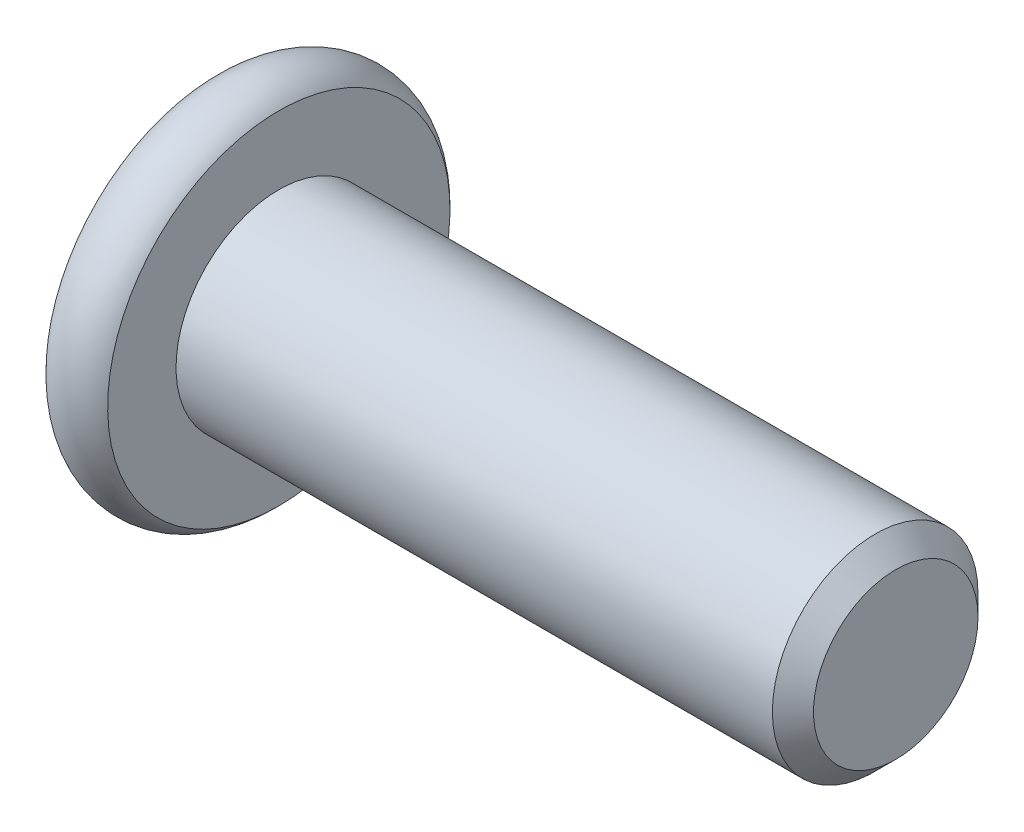
ISO-10303-21;
HEADER;
FILE_DESCRIPTION(('STEP AP214'),'2;1');
FILE_NAME('part.step','',(''),(''),'','','');
FILE_SCHEMA(('AUTOMOTIVE_DESIGN { 1 0 10303 214 1 1 1 1 }'));
ENDSEC;
DATA;
#1=APPLICATION_CONTEXT('core data for automotive mechanical design processes');
#2=APPLICATION_PROTOCOL_DEFINITION('international standard','automotive_design',2000,#1);
#3=PRODUCT_CONTEXT('',#1,'mechanical');
#4=PRODUCT('Part','Part','',(#3));
#5=PRODUCT_RELATED_PRODUCT_CATEGORY('part','',(#4));
#6=PRODUCT_DEFINITION_FORMATION('','',#4);
#7=PRODUCT_DEFINITION_CONTEXT('part definition',#1,'design');
#8=PRODUCT_DEFINITION('design','',#6,#7);
#9=PRODUCT_DEFINITION_SHAPE('','',#8);
#10=(LENGTH_UNIT() NAMED_UNIT(*) SI_UNIT(.MILLI.,.METRE.));
#11=(NAMED_UNIT(*) PLANE_ANGLE_UNIT() SI_UNIT($,.RADIAN.));
#12=(NAMED_UNIT(*) SI_UNIT($,.STERADIAN.) SOLID_ANGLE_UNIT());
#13=UNCERTAINTY_MEASURE_WITH_UNIT(LENGTH_MEASURE(1.E-05),#10,'distance_accuracy_value','');
#14=(GEOMETRIC_REPRESENTATION_CONTEXT(3) GLOBAL_UNCERTAINTY_ASSIGNED_CONTEXT((#13)) GLOBAL_UNIT_ASSIGNED_CONTEXT((#10,
#11,#12)) REPRESENTATION_CONTEXT('',''));
#15=CARTESIAN_POINT('',(0.,0.,0.));
#16=DIRECTION('',(0.,0.,1.));
#17=DIRECTION('',(1.,0.,0.));
#18=AXIS2_PLACEMENT_3D('',#15,#16,#17);
#19=CARTESIAN_POINT('',(-15.,0.,0.));
#20=DIRECTION('',(1.,0.,0.));
#21=DIRECTION('',(0.,0.,-1.));
#22=AXIS2_PLACEMENT_3D('',#19,#20,#21);
#23=CYLINDRICAL_SURFACE('',#22,2.5);
#24=CARTESIAN_POINT('',(-0.5,0.,0.));
#25=DIRECTION('',(1.,0.,0.));
#26=DIRECTION('',(0.,0.,-1.));
#27=AXIS2_PLACEMENT_3D('',#24,#25,#26);
#28=CIRCLE('',#27,2.5);
#29=CARTESIAN_POINT('',(-0.5,0.,-2.5));
#30=VERTEX_POINT('',#29);
#31=EDGE_CURVE('E53',#30,#30,#28,.F.);
#32=ORIENTED_EDGE('',*,*,#31,.T.);
#33=EDGE_LOOP('',(#32));
#34=FACE_BOUND('',#33,.T.);
#35=CARTESIAN_POINT('',(-15.,0.,0.));
#36=DIRECTION('',(-1.,0.,0.));
#37=DIRECTION('',(0.,-1.,0.));
#38=AXIS2_PLACEMENT_3D('',#35,#36,#37);
#39=CIRCLE('',#38,2.5);
#40=CARTESIAN_POINT('',(-15.,-2.50000000000001,0.));
#41=VERTEX_POINT('',#40);
#42=EDGE_CURVE('E129',#41,#41,#39,.F.);
#43=ORIENTED_EDGE('',*,*,#42,.T.);
#44=EDGE_LOOP('',(#43));
#45=FACE_BOUND('',#44,.T.);
#46=ADVANCED_FACE('F39',(#34,#45),#23,.T.);
#47=CARTESIAN_POINT('',(0.,0.,0.));
#48=DIRECTION('',(1.,0.,0.));
#49=DIRECTION('',(0.,0.,-1.));
#50=AXIS2_PLACEMENT_3D('',#47,#48,#49);
#51=PLANE('',#50);
#52=CARTESIAN_POINT('',(0.,0.,0.));
#53=DIRECTION('',(1.,0.,0.));
#54=DIRECTION('',(0.,0.,-1.));
#55=AXIS2_PLACEMENT_3D('',#52,#53,#54);
#56=CIRCLE('',#55,2.);
#57=CARTESIAN_POINT('',(0.,0.,-2.));
#58=VERTEX_POINT('',#57);
#59=EDGE_CURVE('E132',#58,#58,#56,.T.);
#60=ORIENTED_EDGE('',*,*,#59,.T.);
#61=EDGE_LOOP('',(#60));
#62=FACE_BOUND('',#61,.T.);
#63=ADVANCED_FACE('F142',(#62),#51,.T.);
#64=CARTESIAN_POINT('',(0.,0.,0.));
#65=DIRECTION('',(-1.,0.,0.));
#66=DIRECTION('',(0.,0.,1.));
#67=AXIS2_PLACEMENT_3D('',#64,#65,#66);
#68=CONICAL_SURFACE('',#67,2.,0.785398163397446);
#69=ORIENTED_EDGE('',*,*,#31,.F.);
#70=EDGE_LOOP('',(#69));
#71=FACE_BOUND('',#70,.T.);
#72=ORIENTED_EDGE('',*,*,#59,.F.);
#73=EDGE_LOOP('',(#72));
#74=FACE_BOUND('',#73,.T.);
#75=ADVANCED_FACE('F41',(#71,#74),#68,.T.);
#76=CARTESIAN_POINT('',(-16.5,0.,0.));
#77=DIRECTION('',(1.,0.,0.));
#78=DIRECTION('',(0.,1.,0.));
#79=AXIS2_PLACEMENT_3D('',#76,#77,#78);
#80=PLANE('',#79);
#81=CARTESIAN_POINT('',(-16.5,0.,0.));
#82=DIRECTION('',(-1.,0.,0.));
#83=DIRECTION('',(0.,-1.,0.));
#84=AXIS2_PLACEMENT_3D('',#81,#82,#83);
#85=CIRCLE('',#84,1.78205080756889);
#86=CARTESIAN_POINT('',(-16.5,-1.78205080756883,0.));
#87=VERTEX_POINT('',#86);
#88=EDGE_CURVE('E247',#87,#87,#85,.T.);
#89=ORIENTED_EDGE('',*,*,#88,.F.);
#90=EDGE_LOOP('',(#89));
#91=FACE_BOUND('',#90,.T.);
#92=CARTESIAN_POINT('',(-16.5,0.,0.));
#93=DIRECTION('',(-1.,0.,0.));
#94=DIRECTION('',(0.,-1.,0.));
#95=AXIS2_PLACEMENT_3D('',#92,#93,#94);
#96=CIRCLE('',#95,4.16143782776614);
#97=CARTESIAN_POINT('',(-16.5000000000001,-4.16143782776613,0.));
#98=VERTEX_POINT('',#97);
#99=EDGE_CURVE('E126',#98,#98,#96,.T.);
#100=ORIENTED_EDGE('',*,*,#99,.T.);
#101=EDGE_LOOP('',(#100));
#102=FACE_BOUND('',#101,.T.);
#103=ADVANCED_FACE('F141',(#91,#102),#80,.F.);
#104=CARTESIAN_POINT('',(-15.75,0.,0.));
#105=DIRECTION('',(-1.,0.,0.));
#106=DIRECTION('',(0.,-1.,0.));
#107=AXIS2_PLACEMENT_3D('',#104,#105,#106);
#108=TOROIDAL_SURFACE('',#107,3.49999999999999,1.);
#109=ORIENTED_EDGE('',*,*,#99,.F.);
#110=EDGE_LOOP('',(#109));
#111=FACE_BOUND('',#110,.T.);
#112=CARTESIAN_POINT('',(-15.,0.,0.));
#113=DIRECTION('',(-1.,0.,0.));
#114=DIRECTION('',(0.,-1.,0.));
#115=AXIS2_PLACEMENT_3D('',#112,#113,#114);
#116=CIRCLE('',#115,4.16143782776615);
#117=CARTESIAN_POINT('',(-15.0000000000001,-4.16143782776615,0.));
#118=VERTEX_POINT('',#117);
#119=EDGE_CURVE('E123',#118,#118,#116,.T.);
#120=ORIENTED_EDGE('',*,*,#119,.T.);
#121=EDGE_LOOP('',(#120));
#122=FACE_BOUND('',#121,.T.);
#123=ADVANCED_FACE('F153',(#111,#122),#108,.T.);
#124=CARTESIAN_POINT('',(-15.,4.16143782776615,0.));
#125=DIRECTION('',(-1.,0.,0.));
#126=DIRECTION('',(0.,-1.,0.));
#127=AXIS2_PLACEMENT_3D('',#124,#125,#126);
#128=PLANE('',#127);
#129=ORIENTED_EDGE('',*,*,#42,.F.);
#130=EDGE_LOOP('',(#129));
#131=FACE_BOUND('',#130,.T.);
#132=ORIENTED_EDGE('',*,*,#119,.F.);
#133=EDGE_LOOP('',(#132));
#134=FACE_BOUND('',#133,.T.);
#135=ADVANCED_FACE('F157',(#131,#134),#128,.F.);
#136=CARTESIAN_POINT('',(-16.5,0.,0.));
#137=DIRECTION('',(-1.,0.,0.));
#138=DIRECTION('',(0.,-1.,0.));
#139=AXIS2_PLACEMENT_3D('',#136,#137,#138);
#140=CONICAL_SURFACE('',#139,1.78205080756889,0.78539816339745);
#141=ORIENTED_EDGE('',*,*,#88,.T.);
#142=EDGE_LOOP('',(#141));
#143=FACE_BOUND('',#142,.T.);
#144=CARTESIAN_POINT('',(-17.015428085613,-1.74023253176578,1.5));
#145=CARTESIAN_POINT('',(-16.9833811073445,-1.69791724929731,1.5));
#146=CARTESIAN_POINT('',(-16.9516444672841,-1.65536760966792,1.5));
#147=CARTESIAN_POINT('',(-16.8889203936153,-1.56970398156685,1.5));
#148=CARTESIAN_POINT('',(-16.85793314822,-1.52658985542849,1.5));
#149=CARTESIAN_POINT('',(-16.765846164345,-1.39562626326563,1.5));
#150=CARTESIAN_POINT('',(-16.7061145123021,-1.30679868010576,1.5));
#151=CARTESIAN_POINT('',(-16.5887342891012,-1.12044622640215,1.5));
#152=CARTESIAN_POINT('',(-16.5314082774822,-1.02271587306672,1.5));
#153=CARTESIAN_POINT('',(-16.4264632149759,-0.822357214965248,1.5));
#154=CARTESIAN_POINT('',(-16.3788114236896,-0.71974693170191,1.5));
#155=CARTESIAN_POINT('',(-16.320509988315,-0.565852387095082,1.5));
#156=CARTESIAN_POINT('',(-16.3037990535409,-0.516874191424671,1.5));
#157=CARTESIAN_POINT('',(-16.2743077515089,-0.417723988457509,1.5));
#158=CARTESIAN_POINT('',(-16.2615276514219,-0.367551900263875,1.5));
#159=CARTESIAN_POINT('',(-16.2407784202458,-0.267158299056125,1.5));
#160=CARTESIAN_POINT('',(-16.2327260618259,-0.216954261864861,1.5));
#161=CARTESIAN_POINT('',(-16.221591636834,-0.115994915871326,1.5));
#162=CARTESIAN_POINT('',(-16.2185086886377,-0.0652397064615429,1.5));
#163=CARTESIAN_POINT('',(-16.2175473897404,0.034422223487554,1.5));
#164=CARTESIAN_POINT('',(-16.2194789216951,0.0833271701100888,1.5));
#165=CARTESIAN_POINT('',(-16.2280175729676,0.180724293127223,1.5));
#166=CARTESIAN_POINT('',(-16.234625142048,0.229216429361731,1.5));
#167=CARTESIAN_POINT('',(-16.2522650626447,0.326258027697011,1.5));
#168=CARTESIAN_POINT('',(-16.2633731682009,0.374793507450031,1.5));
#169=CARTESIAN_POINT('',(-16.2894198669595,0.470802295834186,1.5));
#170=CARTESIAN_POINT('',(-16.3043581560035,0.518275688481289,1.5));
#171=CARTESIAN_POINT('',(-16.3568395457159,0.667150562065138,1.5));
#172=CARTESIAN_POINT('',(-16.4003351165442,0.766448362426857,1.5));
#173=CARTESIAN_POINT('',(-16.4970587814836,0.960384405673843,1.5));
#174=CARTESIAN_POINT('',(-16.5503217226674,1.05500437383622,1.5));
#175=CARTESIAN_POINT('',(-16.6602258010453,1.23584520321533,1.5));
#176=CARTESIAN_POINT('',(-16.7165682531046,1.32224986946551,1.5));
#177=CARTESIAN_POINT('',(-16.803675572597,1.44954953726474,1.5));
#178=CARTESIAN_POINT('',(-16.8330199906839,1.49143368482424,1.5));
#179=CARTESIAN_POINT('',(-16.892486918293,1.57462914783245,1.5));
#180=CARTESIAN_POINT('',(-16.9226092115007,1.6159406177258,1.5));
#181=CARTESIAN_POINT('',(-16.9530541181365,1.65701358742553,1.5));
#182=B_SPLINE_CURVE_WITH_KNOTS('',3,(#144,#145,#146,#147,#148,#149,#150,#151,#152,#153,#154,
#155,#156,#157,#158,#159,#160,#161,#162,#163,#164,#165,#166,#167,#168,#169,#170,#171,#172,#173,
#174,#175,#176,#177,#178,#179,#180,#181),.UNSPECIFIED.,.F.,.F.,(4,2,2,2,2,2,2,2,2,2,2,2,2,2,2,2,
2,2,4),(0.,0.159238974218355,0.318517535014548,0.639504781932397,0.979137893799214,
1.31760168934359,1.47272233841626,1.62785352839778,1.78016486537349,1.93244917778281,
2.079044862603,2.22565464958335,2.37484213303402,2.52401777304042,2.84828365283778,
3.17372975666753,3.4830303053054,3.63644667013911,3.78982082222915),.UNSPECIFIED.);
#183=CARTESIAN_POINT('',(-16.45,-0.866025403784376,1.5));
#184=VERTEX_POINT('',#183);
#185=CARTESIAN_POINT('',(-16.45,0.866025403784502,1.5));
#186=VERTEX_POINT('',#185);
#187=EDGE_CURVE('E107',#184,#186,#182,.T.);
#188=ORIENTED_EDGE('',*,*,#187,.F.);
#189=CARTESIAN_POINT('',(-16.4501154816001,-1.73216627762265,-0.000200000000000037));
#190=CARTESIAN_POINT('',(-16.4203654760673,-1.70239359975909,0.0513677907370758));
#191=CARTESIAN_POINT('',(-16.3923624839103,-1.67212305186349,0.103797917665201));
#192=CARTESIAN_POINT('',(-16.3410892304402,-1.61039789003613,0.210709034055597));
#193=CARTESIAN_POINT('',(-16.3178475050444,-1.57893740312608,0.265200195814661));
#194=CARTESIAN_POINT('',(-16.2780337289922,-1.51549879897981,0.375079081357248));
#195=CARTESIAN_POINT('',(-16.2613615856709,-1.48353684526804,0.430438809095199));
#196=CARTESIAN_POINT('',(-16.2356744568181,-1.41890915196205,0.542377257477151));
#197=CARTESIAN_POINT('',(-16.2266402904789,-1.38624538781112,0.598952556553009));
#198=CARTESIAN_POINT('',(-16.2184890812269,-1.32995210095293,0.696455389516441));
#199=CARTESIAN_POINT('',(-16.2172822529892,-1.30639533311118,0.737256908280466));
#200=CARTESIAN_POINT('',(-16.2193140571623,-1.25932335290187,0.818787969615858));
#201=CARTESIAN_POINT('',(-16.2225536707483,-1.23580815085307,0.85951749431463));
#202=CARTESIAN_POINT('',(-16.233291985982,-1.1890041497842,0.940584402163416));
#203=CARTESIAN_POINT('',(-16.2407946530187,-1.16571558211713,0.980921384598288));
#204=CARTESIAN_POINT('',(-16.2596516119283,-1.11952932016329,1.06091833691403));
#205=CARTESIAN_POINT('',(-16.2710075570186,-1.0966317980878,1.10057800851621));
#206=CARTESIAN_POINT('',(-16.3047216475927,-1.03798159809692,1.20216313477449));
#207=CARTESIAN_POINT('',(-16.3296218490934,-1.00259267147459,1.26345855370969));
#208=CARTESIAN_POINT('',(-16.3716566532716,-0.950557780604312,1.35358562846331));
#209=CARTESIAN_POINT('',(-16.3864251535591,-0.933410759677085,1.38328513990772));
#210=CARTESIAN_POINT('',(-16.4173105659402,-0.899432101996344,1.44213790138375));
#211=CARTESIAN_POINT('',(-16.4334268341217,-0.882600319285648,1.47129140422064));
#212=CARTESIAN_POINT('',(-16.4501154816001,-0.865909933730538,1.5002));
#213=B_SPLINE_CURVE_WITH_KNOTS('',3,(#189,#190,#191,#192,#193,#194,#195,#196,#197,#198,#199,
#200,#201,#202,#203,#204,#205,#206,#207,#208,#209,#210,#211,#212),.UNSPECIFIED.,.F.,.F.,(4,2,2,
2,2,2,2,2,2,2,2,4),(0.,0.199829143693304,0.400822987382386,0.598623720538181,0.795926240188889,
0.937113067959881,1.07833105577193,1.21968061668222,1.36109089931054,1.58570969637565,
1.69770705470963,1.80965120737193),.UNSPECIFIED.);
#214=CARTESIAN_POINT('',(-16.45,-1.73205080756881,0.));
#215=VERTEX_POINT('',#214);
#216=EDGE_CURVE('E203',#215,#184,#213,.T.);
#217=ORIENTED_EDGE('',*,*,#216,.F.);
#218=CARTESIAN_POINT('',(-16.4501154816001,-0.865909933730537,-1.5002));
#219=CARTESIAN_POINT('',(-16.4203654760673,-0.895682611594102,-1.44863220926292));
#220=CARTESIAN_POINT('',(-16.3923624839103,-0.925953159489702,-1.3962020823348));
#221=CARTESIAN_POINT('',(-16.3410892304401,-0.98767832131706,-1.2892909659444));
#222=CARTESIAN_POINT('',(-16.3178475050444,-1.01913880822711,-1.23479980418534));
#223=CARTESIAN_POINT('',(-16.2780337289922,-1.08257741237338,-1.12492091864275));
#224=CARTESIAN_POINT('',(-16.2613615856709,-1.11453936608515,-1.0695611909048));
#225=CARTESIAN_POINT('',(-16.2356744568181,-1.17916705939114,-0.95762274252285));
#226=CARTESIAN_POINT('',(-16.2266402904789,-1.21183082354207,-0.901047443446992));
#227=CARTESIAN_POINT('',(-16.2184890812269,-1.26812411040026,-0.803544610483559));
#228=CARTESIAN_POINT('',(-16.2172822529892,-1.29168087824201,-0.762743091719534));
#229=CARTESIAN_POINT('',(-16.2193140571623,-1.33875285845132,-0.681212030384142));
#230=CARTESIAN_POINT('',(-16.2225536707483,-1.36226806050012,-0.64048250568537));
#231=CARTESIAN_POINT('',(-16.233291985982,-1.40907206156899,-0.559415597836584));
#232=CARTESIAN_POINT('',(-16.2407946530187,-1.43236062923606,-0.519078615401712));
#233=CARTESIAN_POINT('',(-16.2596516119283,-1.4785468911899,-0.439081663085969));
#234=CARTESIAN_POINT('',(-16.2710075570186,-1.50144441326539,-0.399421991483792));
#235=CARTESIAN_POINT('',(-16.3047216475927,-1.56009461325627,-0.297836865225515));
#236=CARTESIAN_POINT('',(-16.3296218490934,-1.5954835398786,-0.236541446290312));
#237=CARTESIAN_POINT('',(-16.3716566532716,-1.64751843074888,-0.146414371536688));
#238=CARTESIAN_POINT('',(-16.3864251535591,-1.66466545167611,-0.116714860092284));
#239=CARTESIAN_POINT('',(-16.4173105659402,-1.69864410935685,-0.0578620986162505));
#240=CARTESIAN_POINT('',(-16.4334268341217,-1.71547589206754,-0.0287085957793639));
#241=CARTESIAN_POINT('',(-16.4501154816001,-1.73216627762265,0.000199999999999403));
#242=B_SPLINE_CURVE_WITH_KNOTS('',3,(#218,#219,#220,#221,#222,#223,#224,#225,#226,#227,#228,
#229,#230,#231,#232,#233,#234,#235,#236,#237,#238,#239,#240,#241),.UNSPECIFIED.,.F.,.F.,(4,2,2,
2,2,2,2,2,2,2,2,4),(0.,0.199829143693303,0.400822987382388,0.59862372053818,0.795926240188888,
0.93711306795988,1.07833105577193,1.21968061668222,1.36109089931054,1.58570969637565,
1.69770705470963,1.80965120737193),.UNSPECIFIED.);
#243=CARTESIAN_POINT('',(-16.45,-0.866025403784376,-1.5));
#244=VERTEX_POINT('',#243);
#245=EDGE_CURVE('E197',#244,#215,#242,.T.);
#246=ORIENTED_EDGE('',*,*,#245,.F.);
#247=CARTESIAN_POINT('',(-17.015428085613,-1.74023253176578,-1.5));
#248=CARTESIAN_POINT('',(-16.9833811073445,-1.69791724929731,-1.5));
#249=CARTESIAN_POINT('',(-16.9516444672841,-1.65536760966792,-1.5));
#250=CARTESIAN_POINT('',(-16.8889203936153,-1.56970398156685,-1.5));
#251=CARTESIAN_POINT('',(-16.85793314822,-1.52658985542848,-1.5));
#252=CARTESIAN_POINT('',(-16.765846164345,-1.39562626326563,-1.5));
#253=CARTESIAN_POINT('',(-16.7061145123021,-1.30679868010575,-1.5));
#254=CARTESIAN_POINT('',(-16.5887342891012,-1.12044622640214,-1.5));
#255=CARTESIAN_POINT('',(-16.5314082774822,-1.02271587306672,-1.5));
#256=CARTESIAN_POINT('',(-16.4264632149759,-0.822357214965246,-1.5));
#257=CARTESIAN_POINT('',(-16.3788114236896,-0.719746931701908,-1.5));
#258=CARTESIAN_POINT('',(-16.320509988315,-0.565852387095081,-1.5));
#259=CARTESIAN_POINT('',(-16.3037990535409,-0.516874191424669,-1.5));
#260=CARTESIAN_POINT('',(-16.2743077515089,-0.417723988457507,-1.5));
#261=CARTESIAN_POINT('',(-16.2615276514219,-0.367551900263874,-1.5));
#262=CARTESIAN_POINT('',(-16.2407784202458,-0.267158299056124,-1.5));
#263=CARTESIAN_POINT('',(-16.2327260618259,-0.216954261864859,-1.5));
#264=CARTESIAN_POINT('',(-16.221591636834,-0.115994915871324,-1.5));
#265=CARTESIAN_POINT('',(-16.2185086886377,-0.0652397064615415,-1.5));
#266=CARTESIAN_POINT('',(-16.2175473897404,0.0344222234875553,-1.5));
#267=CARTESIAN_POINT('',(-16.2194789216951,0.0833271701100899,-1.5));
#268=CARTESIAN_POINT('',(-16.2280175729676,0.180724293127224,-1.5));
#269=CARTESIAN_POINT('',(-16.234625142048,0.229216429361732,-1.5));
#270=CARTESIAN_POINT('',(-16.2522650626447,0.326258027697012,-1.5));
#271=CARTESIAN_POINT('',(-16.2633731682009,0.374793507450033,-1.5));
#272=CARTESIAN_POINT('',(-16.2894198669595,0.470802295834188,-1.5));
#273=CARTESIAN_POINT('',(-16.3043581560035,0.518275688481291,-1.5));
#274=CARTESIAN_POINT('',(-16.356839545716,0.66715056206514,-1.5));
#275=CARTESIAN_POINT('',(-16.4003351165442,0.76644836242686,-1.5));
#276=CARTESIAN_POINT('',(-16.4970587814836,0.960384405673846,-1.5));
#277=CARTESIAN_POINT('',(-16.5503217226674,1.05500437383622,-1.5));
#278=CARTESIAN_POINT('',(-16.6602258010453,1.23584520321533,-1.5));
#279=CARTESIAN_POINT('',(-16.7165682531046,1.32224986946551,-1.5));
#280=CARTESIAN_POINT('',(-16.803675572597,1.44954953726474,-1.5));
#281=CARTESIAN_POINT('',(-16.8330199906839,1.49143368482424,-1.5));
#282=CARTESIAN_POINT('',(-16.892486918293,1.57462914783245,-1.5));
#283=CARTESIAN_POINT('',(-16.9226092115007,1.6159406177258,-1.5));
#284=CARTESIAN_POINT('',(-16.9530541181365,1.65701358742554,-1.5));
#285=B_SPLINE_CURVE_WITH_KNOTS('',3,(#247,#248,#249,#250,#251,#252,#253,#254,#255,#256,#257,
#258,#259,#260,#261,#262,#263,#264,#265,#266,#267,#268,#269,#270,#271,#272,#273,#274,#275,#276,
#277,#278,#279,#280,#281,#282,#283,#284),.UNSPECIFIED.,.F.,.F.,(4,2,2,2,2,2,2,2,2,2,2,2,2,2,2,2,
2,2,4),(0.,0.159238974218355,0.318517535014547,0.639504781932397,0.979137893799213,
1.31760168934359,1.47272233841626,1.62785352839777,1.78016486537348,1.93244917778281,
2.079044862603,2.22565464958335,2.37484213303401,2.52401777304042,2.84828365283778,
3.17372975666752,3.4830303053054,3.63644667013911,3.78982082222915),.UNSPECIFIED.);
#286=CARTESIAN_POINT('',(-16.45,0.866025403784502,-1.5));
#287=VERTEX_POINT('',#286);
#288=EDGE_CURVE('E60',#287,#244,#285,.F.);
#289=ORIENTED_EDGE('',*,*,#288,.F.);
#290=CARTESIAN_POINT('',(-16.4501154816001,1.73216627762278,0.00020000000000079));
#291=CARTESIAN_POINT('',(-16.4203654760673,1.70239359975921,-0.0513677907370745));
#292=CARTESIAN_POINT('',(-16.3923624839103,1.67212305186361,-0.1037979176652));
#293=CARTESIAN_POINT('',(-16.3410892304401,1.61039789003626,-0.210709034055596));
#294=CARTESIAN_POINT('',(-16.3178475050444,1.5789374031262,-0.265200195814661));
#295=CARTESIAN_POINT('',(-16.2780337289922,1.51549879897993,-0.375079081357249));
#296=CARTESIAN_POINT('',(-16.2613615856709,1.48353684526816,-0.4304388090952));
#297=CARTESIAN_POINT('',(-16.2356744568181,1.41890915196218,-0.542377257477152));
#298=CARTESIAN_POINT('',(-16.2266402904789,1.38624538781124,-0.59895255655301));
#299=CARTESIAN_POINT('',(-16.2184890812268,1.32995210095306,-0.696455389516442));
#300=CARTESIAN_POINT('',(-16.2172822529892,1.3063953331113,-0.737256908280467));
#301=CARTESIAN_POINT('',(-16.2193140571623,1.259323352902,-0.818787969615859));
#302=CARTESIAN_POINT('',(-16.2225536707483,1.23580815085319,-0.859517494314631));
#303=CARTESIAN_POINT('',(-16.233291985982,1.18900414978433,-0.940584402163417));
#304=CARTESIAN_POINT('',(-16.2407946530187,1.16571558211726,-0.980921384598289));
#305=CARTESIAN_POINT('',(-16.2596516119283,1.11952932016341,-1.06091833691403));
#306=CARTESIAN_POINT('',(-16.2710075570186,1.09663179808792,-1.10057800851621));
#307=CARTESIAN_POINT('',(-16.3047216475927,1.03798159809705,-1.20216313477449));
#308=CARTESIAN_POINT('',(-16.3296218490934,1.00259267147472,-1.26345855370969));
#309=CARTESIAN_POINT('',(-16.3716566532716,0.950557780604437,-1.35358562846331));
#310=CARTESIAN_POINT('',(-16.3864251535591,0.93341075967721,-1.38328513990772));
#311=CARTESIAN_POINT('',(-16.4173105659402,0.899432101996469,-1.44213790138375));
#312=CARTESIAN_POINT('',(-16.4334268341217,0.882600319285773,-1.47129140422064));
#313=CARTESIAN_POINT('',(-16.4501154816001,0.865909933730664,-1.5002));
#314=B_SPLINE_CURVE_WITH_KNOTS('',3,(#290,#291,#292,#293,#294,#295,#296,#297,#298,#299,#300,
#301,#302,#303,#304,#305,#306,#307,#308,#309,#310,#311,#312,#313),.UNSPECIFIED.,.F.,.F.,(4,2,2,
2,2,2,2,2,2,2,2,4),(0.,0.199829143693305,0.40082298738239,0.598623720538184,0.795926240188892,
0.937113067959884,1.07833105577193,1.21968061668222,1.36109089931055,1.58570969637566,
1.69770705470964,1.80965120737194),.UNSPECIFIED.);
#315=CARTESIAN_POINT('',(-16.45,1.73205080756894,0.));
#316=VERTEX_POINT('',#315);
#317=EDGE_CURVE('E11',#316,#287,#314,.T.);
#318=ORIENTED_EDGE('',*,*,#317,.F.);
#319=CARTESIAN_POINT('',(-16.4501154816001,0.865909933730664,1.5002));
#320=CARTESIAN_POINT('',(-16.4203654760673,0.895682611594229,1.44863220926292));
#321=CARTESIAN_POINT('',(-16.3923624839103,0.925953159489828,1.3962020823348));
#322=CARTESIAN_POINT('',(-16.3410892304401,0.987678321317186,1.2892909659444));
#323=CARTESIAN_POINT('',(-16.3178475050444,1.01913880822724,1.23479980418534));
#324=CARTESIAN_POINT('',(-16.2780337289922,1.08257741237351,1.12492091864275));
#325=CARTESIAN_POINT('',(-16.2613615856709,1.11453936608528,1.0695611909048));
#326=CARTESIAN_POINT('',(-16.2356744568181,1.17916705939126,0.957622742522848));
#327=CARTESIAN_POINT('',(-16.2266402904789,1.21183082354219,0.901047443446991));
#328=CARTESIAN_POINT('',(-16.2184890812268,1.26812411040038,0.803544610483559));
#329=CARTESIAN_POINT('',(-16.2172822529892,1.29168087824214,0.762743091719533));
#330=CARTESIAN_POINT('',(-16.2193140571623,1.33875285845144,0.681212030384141));
#331=CARTESIAN_POINT('',(-16.2225536707483,1.36226806050024,0.64048250568537));
#332=CARTESIAN_POINT('',(-16.233291985982,1.40907206156911,0.559415597836584));
#333=CARTESIAN_POINT('',(-16.2407946530187,1.43236062923618,0.519078615401711));
#334=CARTESIAN_POINT('',(-16.2596516119283,1.47854689119003,0.439081663085969));
#335=CARTESIAN_POINT('',(-16.2710075570186,1.50144441326552,0.399421991483792));
#336=CARTESIAN_POINT('',(-16.3047216475927,1.56009461325639,0.297836865225516));
#337=CARTESIAN_POINT('',(-16.3296218490934,1.59548353987872,0.236541446290311));
#338=CARTESIAN_POINT('',(-16.3716566532716,1.647518430749,0.146414371536687));
#339=CARTESIAN_POINT('',(-16.3864251535591,1.66466545167623,0.116714860092284));
#340=CARTESIAN_POINT('',(-16.4173105659402,1.69864410935697,0.0578620986162506));
#341=CARTESIAN_POINT('',(-16.4334268341217,1.71547589206767,0.0287085957793643));
#342=CARTESIAN_POINT('',(-16.4501154816001,1.73216627762278,-0.000199999999998978));
#343=B_SPLINE_CURVE_WITH_KNOTS('',3,(#319,#320,#321,#322,#323,#324,#325,#326,#327,#328,#329,
#330,#331,#332,#333,#334,#335,#336,#337,#338,#339,#340,#341,#342),.UNSPECIFIED.,.F.,.F.,(4,2,2,
2,2,2,2,2,2,2,2,4),(0.,0.199829143693304,0.400822987382388,0.598623720538181,0.795926240188888,
0.93711306795988,1.07833105577193,1.21968061668222,1.36109089931054,1.58570969637565,
1.69770705470963,1.80965120737193),.UNSPECIFIED.);
#344=EDGE_CURVE('E98',#186,#316,#343,.T.);
#345=ORIENTED_EDGE('',*,*,#344,.F.);
#346=EDGE_LOOP('',(#188,#217,#246,#289,#318,#345));
#347=FACE_BOUND('',#346,.T.);
#348=ADVANCED_FACE('F97',(#143,#347),#140,.F.);
#349=CARTESIAN_POINT('',(-14.2,0.,0.));
#350=DIRECTION('',(-1.,0.,0.));
#351=DIRECTION('',(0.,-1.,0.));
#352=AXIS2_PLACEMENT_3D('',#349,#350,#351);
#353=PLANE('',#352);
#354=DIRECTION('',(0.,0.5,-0.866025403784439));
#355=VECTOR('',#354,1.);
#356=CARTESIAN_POINT('',(-14.2,0.866025403784493,1.5));
#357=LINE('',#356,#355);
#358=CARTESIAN_POINT('',(-14.2,0.866025403784493,1.5));
#359=VERTEX_POINT('',#358);
#360=CARTESIAN_POINT('',(-14.2,1.73205080756893,0.));
#361=VERTEX_POINT('',#360);
#362=EDGE_CURVE('E106',#359,#361,#357,.T.);
#363=ORIENTED_EDGE('',*,*,#362,.T.);
#364=DIRECTION('',(0.,-0.5,-0.866025403784439));
#365=VECTOR('',#364,1.);
#366=CARTESIAN_POINT('',(-14.2,1.73205080756893,0.));
#367=LINE('',#366,#365);
#368=CARTESIAN_POINT('',(-14.2,0.866025403784493,-1.5));
#369=VERTEX_POINT('',#368);
#370=EDGE_CURVE('E111',#361,#369,#367,.T.);
#371=ORIENTED_EDGE('',*,*,#370,.T.);
#372=DIRECTION('',(0.,-1.,0.));
#373=VECTOR('',#372,1.);
#374=CARTESIAN_POINT('',(-14.2,0.866025403784493,-1.5));
#375=LINE('',#374,#373);
#376=CARTESIAN_POINT('',(-14.2,-0.866025403784384,-1.5));
#377=VERTEX_POINT('',#376);
#378=EDGE_CURVE('E229',#369,#377,#375,.T.);
#379=ORIENTED_EDGE('',*,*,#378,.T.);
#380=DIRECTION('',(0.,-0.5,0.866025403784438));
#381=VECTOR('',#380,1.);
#382=CARTESIAN_POINT('',(-14.2,-0.866025403784384,-1.5));
#383=LINE('',#382,#381);
#384=CARTESIAN_POINT('',(-14.2,-1.73205080756882,0.));
#385=VERTEX_POINT('',#384);
#386=EDGE_CURVE('E233',#377,#385,#383,.T.);
#387=ORIENTED_EDGE('',*,*,#386,.T.);
#388=DIRECTION('',(0.,0.5,0.866025403784439));
#389=VECTOR('',#388,1.);
#390=CARTESIAN_POINT('',(-14.2,-1.73205080756882,0.));
#391=LINE('',#390,#389);
#392=CARTESIAN_POINT('',(-14.2,-0.866025403784385,1.5));
#393=VERTEX_POINT('',#392);
#394=EDGE_CURVE('E119',#385,#393,#391,.T.);
#395=ORIENTED_EDGE('',*,*,#394,.T.);
#396=DIRECTION('',(0.,1.,0.));
#397=VECTOR('',#396,1.);
#398=CARTESIAN_POINT('',(-14.2,-0.866025403784385,1.5));
#399=LINE('',#398,#397);
#400=EDGE_CURVE('E114',#393,#359,#399,.T.);
#401=ORIENTED_EDGE('',*,*,#400,.T.);
#402=EDGE_LOOP('',(#363,#371,#379,#387,#395,#401));
#403=FACE_BOUND('',#402,.T.);
#404=ADVANCED_FACE('F183',(#403),#353,.T.);
#405=CARTESIAN_POINT('',(-14.2,1.73205080756893,0.));
#406=DIRECTION('',(0.,0.866025403784439,-0.5));
#407=DIRECTION('',(0.,0.5,0.866025403784439));
#408=AXIS2_PLACEMENT_3D('',#405,#406,#407);
#409=PLANE('',#408);
#410=DIRECTION('',(-1.,0.,0.));
#411=VECTOR('',#410,1.);
#412=CARTESIAN_POINT('',(-14.2,1.73205080756893,0.));
#413=LINE('',#412,#411);
#414=EDGE_CURVE('E104',#361,#316,#413,.T.);
#415=ORIENTED_EDGE('',*,*,#414,.T.);
#416=ORIENTED_EDGE('',*,*,#317,.T.);
#417=DIRECTION('',(-1.,0.,0.));
#418=VECTOR('',#417,1.);
#419=CARTESIAN_POINT('',(-14.2,0.866025403784493,-1.5));
#420=LINE('',#419,#418);
#421=EDGE_CURVE('E113',#369,#287,#420,.T.);
#422=ORIENTED_EDGE('',*,*,#421,.F.);
#423=ORIENTED_EDGE('',*,*,#370,.F.);
#424=EDGE_LOOP('',(#415,#416,#422,#423));
#425=FACE_BOUND('',#424,.T.);
#426=ADVANCED_FACE('F109',(#425),#409,.F.);
#427=CARTESIAN_POINT('',(-14.2,0.866025403784493,-1.5));
#428=DIRECTION('',(0.,0.,-1.));
#429=DIRECTION('',(-1.,0.,0.));
#430=AXIS2_PLACEMENT_3D('',#427,#428,#429);
#431=PLANE('',#430);
#432=ORIENTED_EDGE('',*,*,#421,.T.);
#433=ORIENTED_EDGE('',*,*,#288,.T.);
#434=DIRECTION('',(-1.,0.,0.));
#435=VECTOR('',#434,1.);
#436=CARTESIAN_POINT('',(-14.2,-0.866025403784384,-1.5));
#437=LINE('',#436,#435);
#438=EDGE_CURVE('E116',#377,#244,#437,.T.);
#439=ORIENTED_EDGE('',*,*,#438,.F.);
#440=ORIENTED_EDGE('',*,*,#378,.F.);
#441=EDGE_LOOP('',(#432,#433,#439,#440));
#442=FACE_BOUND('',#441,.T.);
#443=ADVANCED_FACE('F218',(#442),#431,.F.);
#444=CARTESIAN_POINT('',(-14.2,-0.866025403784384,-1.5));
#445=DIRECTION('',(0.,-0.866025403784438,-0.5));
#446=DIRECTION('',(0.,0.5,-0.866025403784438));
#447=AXIS2_PLACEMENT_3D('',#444,#445,#446);
#448=PLANE('',#447);
#449=ORIENTED_EDGE('',*,*,#438,.T.);
#450=ORIENTED_EDGE('',*,*,#245,.T.);
#451=DIRECTION('',(-1.,0.,0.));
#452=VECTOR('',#451,1.);
#453=CARTESIAN_POINT('',(-14.2,-1.73205080756882,0.));
#454=LINE('',#453,#452);
#455=EDGE_CURVE('E243',#385,#215,#454,.T.);
#456=ORIENTED_EDGE('',*,*,#455,.F.);
#457=ORIENTED_EDGE('',*,*,#386,.F.);
#458=EDGE_LOOP('',(#449,#450,#456,#457));
#459=FACE_BOUND('',#458,.T.);
#460=ADVANCED_FACE('F213',(#459),#448,.F.);
#461=CARTESIAN_POINT('',(-14.2,-1.73205080756882,0.));
#462=DIRECTION('',(0.,-0.866025403784439,0.5));
#463=DIRECTION('',(0.,-0.5,-0.866025403784439));
#464=AXIS2_PLACEMENT_3D('',#461,#462,#463);
#465=PLANE('',#464);
#466=ORIENTED_EDGE('',*,*,#455,.T.);
#467=ORIENTED_EDGE('',*,*,#216,.T.);
#468=DIRECTION('',(-1.,0.,0.));
#469=VECTOR('',#468,1.);
#470=CARTESIAN_POINT('',(-14.2,-0.866025403784385,1.5));
#471=LINE('',#470,#469);
#472=EDGE_CURVE('E240',#393,#184,#471,.T.);
#473=ORIENTED_EDGE('',*,*,#472,.F.);
#474=ORIENTED_EDGE('',*,*,#394,.F.);
#475=EDGE_LOOP('',(#466,#467,#473,#474));
#476=FACE_BOUND('',#475,.T.);
#477=ADVANCED_FACE('F210',(#476),#465,.F.);
#478=CARTESIAN_POINT('',(-14.2,-0.866025403784385,1.5));
#479=DIRECTION('',(0.,0.,1.));
#480=DIRECTION('',(1.,0.,0.));
#481=AXIS2_PLACEMENT_3D('',#478,#479,#480);
#482=PLANE('',#481);
#483=ORIENTED_EDGE('',*,*,#472,.T.);
#484=ORIENTED_EDGE('',*,*,#187,.T.);
#485=DIRECTION('',(-1.,0.,0.));
#486=VECTOR('',#485,1.);
#487=CARTESIAN_POINT('',(-14.2,0.866025403784493,1.5));
#488=LINE('',#487,#486);
#489=EDGE_CURVE('E67',#359,#186,#488,.T.);
#490=ORIENTED_EDGE('',*,*,#489,.F.);
#491=ORIENTED_EDGE('',*,*,#400,.F.);
#492=EDGE_LOOP('',(#483,#484,#490,#491));
#493=FACE_BOUND('',#492,.T.);
#494=ADVANCED_FACE('F164',(#493),#482,.F.);
#495=CARTESIAN_POINT('',(-14.2,0.866025403784493,1.5));
#496=DIRECTION('',(0.,0.866025403784439,0.5));
#497=DIRECTION('',(0.,-0.5,0.866025403784439));
#498=AXIS2_PLACEMENT_3D('',#495,#496,#497);
#499=PLANE('',#498);
#500=ORIENTED_EDGE('',*,*,#489,.T.);
#501=ORIENTED_EDGE('',*,*,#344,.T.);
#502=ORIENTED_EDGE('',*,*,#414,.F.);
#503=ORIENTED_EDGE('',*,*,#362,.F.);
#504=EDGE_LOOP('',(#500,#501,#502,#503));
#505=FACE_BOUND('',#504,.T.);
#506=ADVANCED_FACE('F103',(#505),#499,.F.);
#507=CLOSED_SHELL('',(#46,#63,#75,#103,#123,#135,#348,#404,#426,#443,#460,#477,#494,#506));
#508=MANIFOLD_SOLID_BREP('B2',#507);
#509=ADVANCED_BREP_SHAPE_REPRESENTATION('',(#18,#508),#14);
#510=SHAPE_DEFINITION_REPRESENTATION(#9,#509);
ENDSEC;
END-ISO-10303-21;
